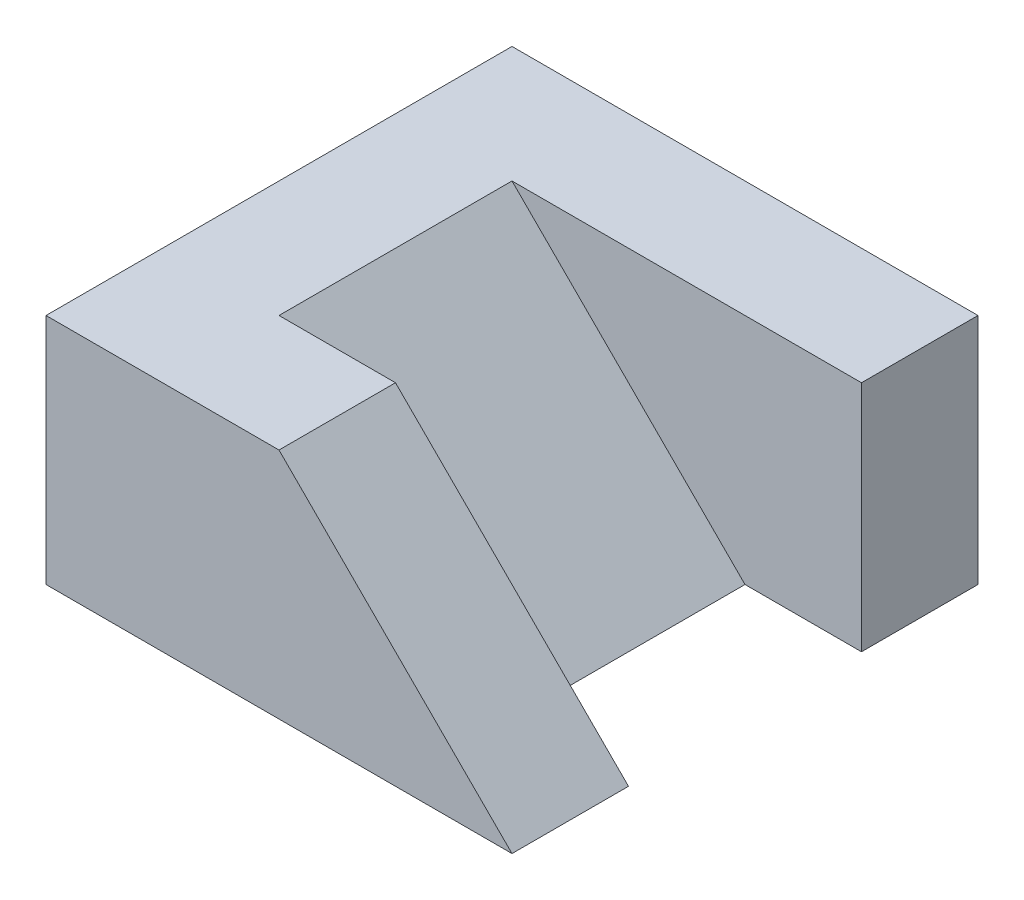
ISO-10303-21;
HEADER;
FILE_DESCRIPTION(('STEP AP214'),'2;1');
FILE_NAME('part.step','',(''),(''),'','','');
FILE_SCHEMA(('AUTOMOTIVE_DESIGN { 1 0 10303 214 1 1 1 1 }'));
ENDSEC;
DATA;
#1=APPLICATION_CONTEXT('core data for automotive mechanical design processes');
#2=APPLICATION_PROTOCOL_DEFINITION('international standard','automotive_design',2000,#1);
#3=PRODUCT_CONTEXT('',#1,'mechanical');
#4=PRODUCT('Part','Part','',(#3));
#5=PRODUCT_RELATED_PRODUCT_CATEGORY('part','',(#4));
#6=PRODUCT_DEFINITION_FORMATION('','',#4);
#7=PRODUCT_DEFINITION_CONTEXT('part definition',#1,'design');
#8=PRODUCT_DEFINITION('design','',#6,#7);
#9=PRODUCT_DEFINITION_SHAPE('','',#8);
#10=(LENGTH_UNIT() NAMED_UNIT(*) SI_UNIT(.MILLI.,.METRE.));
#11=(NAMED_UNIT(*) PLANE_ANGLE_UNIT() SI_UNIT($,.RADIAN.));
#12=(NAMED_UNIT(*) SI_UNIT($,.STERADIAN.) SOLID_ANGLE_UNIT());
#13=UNCERTAINTY_MEASURE_WITH_UNIT(LENGTH_MEASURE(1.E-05),#10,'distance_accuracy_value','');
#14=(GEOMETRIC_REPRESENTATION_CONTEXT(3) GLOBAL_UNCERTAINTY_ASSIGNED_CONTEXT((#13)) GLOBAL_UNIT_ASSIGNED_CONTEXT((#10,
#11,#12)) REPRESENTATION_CONTEXT('',''));
#15=CARTESIAN_POINT('',(0.,0.,0.));
#16=DIRECTION('',(0.,0.,1.));
#17=DIRECTION('',(1.,0.,0.));
#18=AXIS2_PLACEMENT_3D('',#15,#16,#17);
#19=CARTESIAN_POINT('',(0.,10.,0.));
#20=DIRECTION('',(0.,1.,0.));
#21=DIRECTION('',(0.,0.,1.));
#22=AXIS2_PLACEMENT_3D('',#19,#20,#21);
#23=PLANE('',#22);
#24=DIRECTION('',(0.,0.,1.));
#25=VECTOR('',#24,1.);
#26=CARTESIAN_POINT('',(0.,10.,5.));
#27=LINE('',#26,#25);
#28=CARTESIAN_POINT('',(0.,10.,5.));
#29=VERTEX_POINT('',#28);
#30=CARTESIAN_POINT('',(0.,10.,10.));
#31=VERTEX_POINT('',#30);
#32=EDGE_CURVE('E112',#29,#31,#27,.T.);
#33=ORIENTED_EDGE('',*,*,#32,.F.);
#34=DIRECTION('',(-1.,0.,0.));
#35=VECTOR('',#34,1.);
#36=CARTESIAN_POINT('',(0.,10.,5.));
#37=LINE('',#36,#35);
#38=CARTESIAN_POINT('',(-5.,10.,5.));
#39=VERTEX_POINT('',#38);
#40=EDGE_CURVE('E121',#29,#39,#37,.T.);
#41=ORIENTED_EDGE('',*,*,#40,.T.);
#42=DIRECTION('',(0.,0.,1.));
#43=VECTOR('',#42,1.);
#44=CARTESIAN_POINT('',(-5.,10.,-5.));
#45=LINE('',#44,#43);
#46=CARTESIAN_POINT('',(-5.,10.,-5.));
#47=VERTEX_POINT('',#46);
#48=EDGE_CURVE('E136',#47,#39,#45,.T.);
#49=ORIENTED_EDGE('',*,*,#48,.F.);
#50=DIRECTION('',(-1.,0.,0.));
#51=VECTOR('',#50,1.);
#52=CARTESIAN_POINT('',(0.,10.,-5.));
#53=LINE('',#52,#51);
#54=CARTESIAN_POINT('',(10.,10.,-5.));
#55=VERTEX_POINT('',#54);
#56=EDGE_CURVE('E151',#55,#47,#53,.T.);
#57=ORIENTED_EDGE('',*,*,#56,.F.);
#58=DIRECTION('',(0.,0.,1.));
#59=VECTOR('',#58,1.);
#60=CARTESIAN_POINT('',(10.,10.,0.));
#61=LINE('',#60,#59);
#62=CARTESIAN_POINT('',(10.,10.,-10.));
#63=VERTEX_POINT('',#62);
#64=EDGE_CURVE('E168',#63,#55,#61,.T.);
#65=ORIENTED_EDGE('',*,*,#64,.F.);
#66=DIRECTION('',(-1.,0.,0.));
#67=VECTOR('',#66,1.);
#68=CARTESIAN_POINT('',(0.,10.,-10.));
#69=LINE('',#68,#67);
#70=CARTESIAN_POINT('',(-10.,10.,-10.));
#71=VERTEX_POINT('',#70);
#72=EDGE_CURVE('E159',#63,#71,#69,.T.);
#73=ORIENTED_EDGE('',*,*,#72,.T.);
#74=DIRECTION('',(0.,0.,1.));
#75=VECTOR('',#74,1.);
#76=CARTESIAN_POINT('',(-10.,10.,0.));
#77=LINE('',#76,#75);
#78=CARTESIAN_POINT('',(-9.99999999999999,10.,10.));
#79=VERTEX_POINT('',#78);
#80=EDGE_CURVE('E128',#71,#79,#77,.T.);
#81=ORIENTED_EDGE('',*,*,#80,.T.);
#82=DIRECTION('',(-1.,0.,0.));
#83=VECTOR('',#82,1.);
#84=CARTESIAN_POINT('',(0.,10.,10.));
#85=LINE('',#84,#83);
#86=EDGE_CURVE('E56',#31,#79,#85,.T.);
#87=ORIENTED_EDGE('',*,*,#86,.F.);
#88=EDGE_LOOP('',(#33,#41,#49,#57,#65,#73,#81,#87));
#89=FACE_BOUND('',#88,.T.);
#90=ADVANCED_FACE('F39',(#89),#23,.T.);
#91=CARTESIAN_POINT('',(0.,10.,-5.));
#92=DIRECTION('',(0.,0.,1.));
#93=DIRECTION('',(1.,0.,0.));
#94=AXIS2_PLACEMENT_3D('',#91,#92,#93);
#95=PLANE('',#94);
#96=DIRECTION('',(-1.,0.,0.));
#97=VECTOR('',#96,1.);
#98=CARTESIAN_POINT('',(0.,0.,-5.));
#99=LINE('',#98,#97);
#100=CARTESIAN_POINT('',(10.,0.,-5.));
#101=VERTEX_POINT('',#100);
#102=CARTESIAN_POINT('',(5.,0.,-5.));
#103=VERTEX_POINT('',#102);
#104=EDGE_CURVE('E135',#101,#103,#99,.T.);
#105=ORIENTED_EDGE('',*,*,#104,.F.);
#106=DIRECTION('',(0.,-1.,0.));
#107=VECTOR('',#106,1.);
#108=CARTESIAN_POINT('',(10.,10.,-5.));
#109=LINE('',#108,#107);
#110=EDGE_CURVE('E11',#55,#101,#109,.T.);
#111=ORIENTED_EDGE('',*,*,#110,.F.);
#112=ORIENTED_EDGE('',*,*,#56,.T.);
#113=DIRECTION('',(0.707106781186547,-0.707106781186548,0.));
#114=VECTOR('',#113,1.);
#115=CARTESIAN_POINT('',(-5.,10.,-5.));
#116=LINE('',#115,#114);
#117=EDGE_CURVE('E171',#47,#103,#116,.T.);
#118=ORIENTED_EDGE('',*,*,#117,.T.);
#119=EDGE_LOOP('',(#105,#111,#112,#118));
#120=FACE_BOUND('',#119,.T.);
#121=ADVANCED_FACE('F41',(#120),#95,.T.);
#122=CARTESIAN_POINT('',(10.,10.,0.));
#123=DIRECTION('',(1.,0.,0.));
#124=DIRECTION('',(0.,0.,-1.));
#125=AXIS2_PLACEMENT_3D('',#122,#123,#124);
#126=PLANE('',#125);
#127=DIRECTION('',(0.,0.,1.));
#128=VECTOR('',#127,1.);
#129=CARTESIAN_POINT('',(10.,0.,0.));
#130=LINE('',#129,#128);
#131=CARTESIAN_POINT('',(10.,0.,-10.));
#132=VERTEX_POINT('',#131);
#133=EDGE_CURVE('E139',#132,#101,#130,.T.);
#134=ORIENTED_EDGE('',*,*,#133,.F.);
#135=DIRECTION('',(0.,-1.,0.));
#136=VECTOR('',#135,1.);
#137=CARTESIAN_POINT('',(10.,10.,-10.));
#138=LINE('',#137,#136);
#139=EDGE_CURVE('E48',#63,#132,#138,.T.);
#140=ORIENTED_EDGE('',*,*,#139,.F.);
#141=ORIENTED_EDGE('',*,*,#64,.T.);
#142=ORIENTED_EDGE('',*,*,#110,.T.);
#143=EDGE_LOOP('',(#134,#140,#141,#142));
#144=FACE_BOUND('',#143,.T.);
#145=ADVANCED_FACE('F167',(#144),#126,.T.);
#146=CARTESIAN_POINT('',(0.,10.,-10.));
#147=DIRECTION('',(0.,0.,1.));
#148=DIRECTION('',(1.,0.,0.));
#149=AXIS2_PLACEMENT_3D('',#146,#147,#148);
#150=PLANE('',#149);
#151=DIRECTION('',(-1.,0.,0.));
#152=VECTOR('',#151,1.);
#153=CARTESIAN_POINT('',(0.,0.,-10.));
#154=LINE('',#153,#152);
#155=CARTESIAN_POINT('',(-10.,0.,-10.));
#156=VERTEX_POINT('',#155);
#157=EDGE_CURVE('E142',#132,#156,#154,.T.);
#158=ORIENTED_EDGE('',*,*,#157,.T.);
#159=DIRECTION('',(0.,-1.,0.));
#160=VECTOR('',#159,1.);
#161=CARTESIAN_POINT('',(-10.,10.,-10.));
#162=LINE('',#161,#160);
#163=EDGE_CURVE('E126',#71,#156,#162,.T.);
#164=ORIENTED_EDGE('',*,*,#163,.F.);
#165=ORIENTED_EDGE('',*,*,#72,.F.);
#166=ORIENTED_EDGE('',*,*,#139,.T.);
#167=EDGE_LOOP('',(#158,#164,#165,#166));
#168=FACE_BOUND('',#167,.T.);
#169=ADVANCED_FACE('F157',(#168),#150,.F.);
#170=CARTESIAN_POINT('',(-10.,10.,0.));
#171=DIRECTION('',(1.,0.,0.));
#172=DIRECTION('',(0.,0.,-1.));
#173=AXIS2_PLACEMENT_3D('',#170,#171,#172);
#174=PLANE('',#173);
#175=DIRECTION('',(0.,0.,1.));
#176=VECTOR('',#175,1.);
#177=CARTESIAN_POINT('',(-10.,0.,0.));
#178=LINE('',#177,#176);
#179=CARTESIAN_POINT('',(-9.99999999999999,0.,10.));
#180=VERTEX_POINT('',#179);
#181=EDGE_CURVE('E144',#156,#180,#178,.T.);
#182=ORIENTED_EDGE('',*,*,#181,.T.);
#183=DIRECTION('',(0.,-1.,0.));
#184=VECTOR('',#183,1.);
#185=CARTESIAN_POINT('',(-9.99999999999999,10.,10.));
#186=LINE('',#185,#184);
#187=EDGE_CURVE('E124',#79,#180,#186,.T.);
#188=ORIENTED_EDGE('',*,*,#187,.F.);
#189=ORIENTED_EDGE('',*,*,#80,.F.);
#190=ORIENTED_EDGE('',*,*,#163,.T.);
#191=EDGE_LOOP('',(#182,#188,#189,#190));
#192=FACE_BOUND('',#191,.T.);
#193=ADVANCED_FACE('F182',(#192),#174,.F.);
#194=CARTESIAN_POINT('',(0.,10.,10.));
#195=DIRECTION('',(0.,0.,1.));
#196=DIRECTION('',(1.,0.,0.));
#197=AXIS2_PLACEMENT_3D('',#194,#195,#196);
#198=PLANE('',#197);
#199=DIRECTION('',(0.707106781186548,-0.707106781186548,0.));
#200=VECTOR('',#199,1.);
#201=CARTESIAN_POINT('',(0.,10.,10.));
#202=LINE('',#201,#200);
#203=CARTESIAN_POINT('',(10.,0.,10.));
#204=VERTEX_POINT('',#203);
#205=EDGE_CURVE('E78',#31,#204,#202,.T.);
#206=ORIENTED_EDGE('',*,*,#205,.F.);
#207=ORIENTED_EDGE('',*,*,#86,.T.);
#208=ORIENTED_EDGE('',*,*,#187,.T.);
#209=DIRECTION('',(-1.,0.,0.));
#210=VECTOR('',#209,1.);
#211=CARTESIAN_POINT('',(0.,0.,10.));
#212=LINE('',#211,#210);
#213=EDGE_CURVE('E147',#204,#180,#212,.T.);
#214=ORIENTED_EDGE('',*,*,#213,.F.);
#215=EDGE_LOOP('',(#206,#207,#208,#214));
#216=FACE_BOUND('',#215,.T.);
#217=ADVANCED_FACE('F183',(#216),#198,.T.);
#218=CARTESIAN_POINT('',(0.,10.,5.));
#219=DIRECTION('',(0.,0.,1.));
#220=DIRECTION('',(1.,0.,0.));
#221=AXIS2_PLACEMENT_3D('',#218,#219,#220);
#222=PLANE('',#221);
#223=ORIENTED_EDGE('',*,*,#40,.F.);
#224=DIRECTION('',(0.707106781186548,-0.707106781186548,0.));
#225=VECTOR('',#224,1.);
#226=CARTESIAN_POINT('',(0.,10.,5.));
#227=LINE('',#226,#225);
#228=CARTESIAN_POINT('',(10.,0.,5.));
#229=VERTEX_POINT('',#228);
#230=EDGE_CURVE('E109',#29,#229,#227,.T.);
#231=ORIENTED_EDGE('',*,*,#230,.T.);
#232=DIRECTION('',(-1.,0.,0.));
#233=VECTOR('',#232,1.);
#234=CARTESIAN_POINT('',(0.,0.,5.));
#235=LINE('',#234,#233);
#236=CARTESIAN_POINT('',(5.,0.,5.));
#237=VERTEX_POINT('',#236);
#238=EDGE_CURVE('E150',#229,#237,#235,.T.);
#239=ORIENTED_EDGE('',*,*,#238,.T.);
#240=DIRECTION('',(0.707106781186547,-0.707106781186548,0.));
#241=VECTOR('',#240,1.);
#242=CARTESIAN_POINT('',(-5.,10.,5.));
#243=LINE('',#242,#241);
#244=EDGE_CURVE('E86',#39,#237,#243,.T.);
#245=ORIENTED_EDGE('',*,*,#244,.F.);
#246=EDGE_LOOP('',(#223,#231,#239,#245));
#247=FACE_BOUND('',#246,.T.);
#248=ADVANCED_FACE('F123',(#247),#222,.F.);
#249=CARTESIAN_POINT('',(0.,0.,0.));
#250=DIRECTION('',(0.,1.,0.));
#251=DIRECTION('',(0.,0.,1.));
#252=AXIS2_PLACEMENT_3D('',#249,#250,#251);
#253=PLANE('',#252);
#254=DIRECTION('',(0.,0.,1.));
#255=VECTOR('',#254,1.);
#256=CARTESIAN_POINT('',(5.,0.,0.));
#257=LINE('',#256,#255);
#258=EDGE_CURVE('E132',#103,#237,#257,.T.);
#259=ORIENTED_EDGE('',*,*,#258,.T.);
#260=ORIENTED_EDGE('',*,*,#238,.F.);
#261=EDGE_CURVE('E114',#229,#204,#130,.T.);
#262=ORIENTED_EDGE('',*,*,#261,.T.);
#263=ORIENTED_EDGE('',*,*,#213,.T.);
#264=ORIENTED_EDGE('',*,*,#181,.F.);
#265=ORIENTED_EDGE('',*,*,#157,.F.);
#266=ORIENTED_EDGE('',*,*,#133,.T.);
#267=ORIENTED_EDGE('',*,*,#104,.T.);
#268=EDGE_LOOP('',(#259,#260,#262,#263,#264,#265,#266,#267));
#269=FACE_BOUND('',#268,.T.);
#270=ADVANCED_FACE('F166',(#269),#253,.F.);
#271=CARTESIAN_POINT('',(-5.,10.,-5.));
#272=DIRECTION('',(-0.707106781186548,-0.707106781186547,0.));
#273=DIRECTION('',(0.707106781186547,-0.707106781186548,0.));
#274=AXIS2_PLACEMENT_3D('',#271,#272,#273);
#275=PLANE('',#274);
#276=ORIENTED_EDGE('',*,*,#244,.T.);
#277=ORIENTED_EDGE('',*,*,#258,.F.);
#278=ORIENTED_EDGE('',*,*,#117,.F.);
#279=ORIENTED_EDGE('',*,*,#48,.T.);
#280=EDGE_LOOP('',(#276,#277,#278,#279));
#281=FACE_BOUND('',#280,.T.);
#282=ADVANCED_FACE('F172',(#281),#275,.F.);
#283=CARTESIAN_POINT('',(0.,10.,5.));
#284=DIRECTION('',(-0.707106781186548,-0.707106781186548,0.));
#285=DIRECTION('',(0.707106781186548,-0.707106781186548,0.));
#286=AXIS2_PLACEMENT_3D('',#283,#284,#285);
#287=PLANE('',#286);
#288=ORIENTED_EDGE('',*,*,#205,.T.);
#289=ORIENTED_EDGE('',*,*,#261,.F.);
#290=ORIENTED_EDGE('',*,*,#230,.F.);
#291=ORIENTED_EDGE('',*,*,#32,.T.);
#292=EDGE_LOOP('',(#288,#289,#290,#291));
#293=FACE_BOUND('',#292,.T.);
#294=ADVANCED_FACE('F111',(#293),#287,.F.);
#295=CLOSED_SHELL('',(#90,#121,#145,#169,#193,#217,#248,#270,#282,#294));
#296=MANIFOLD_SOLID_BREP('B2',#295);
#297=ADVANCED_BREP_SHAPE_REPRESENTATION('',(#18,#296),#14);
#298=SHAPE_DEFINITION_REPRESENTATION(#9,#297);
ENDSEC;
END-ISO-10303-21;
